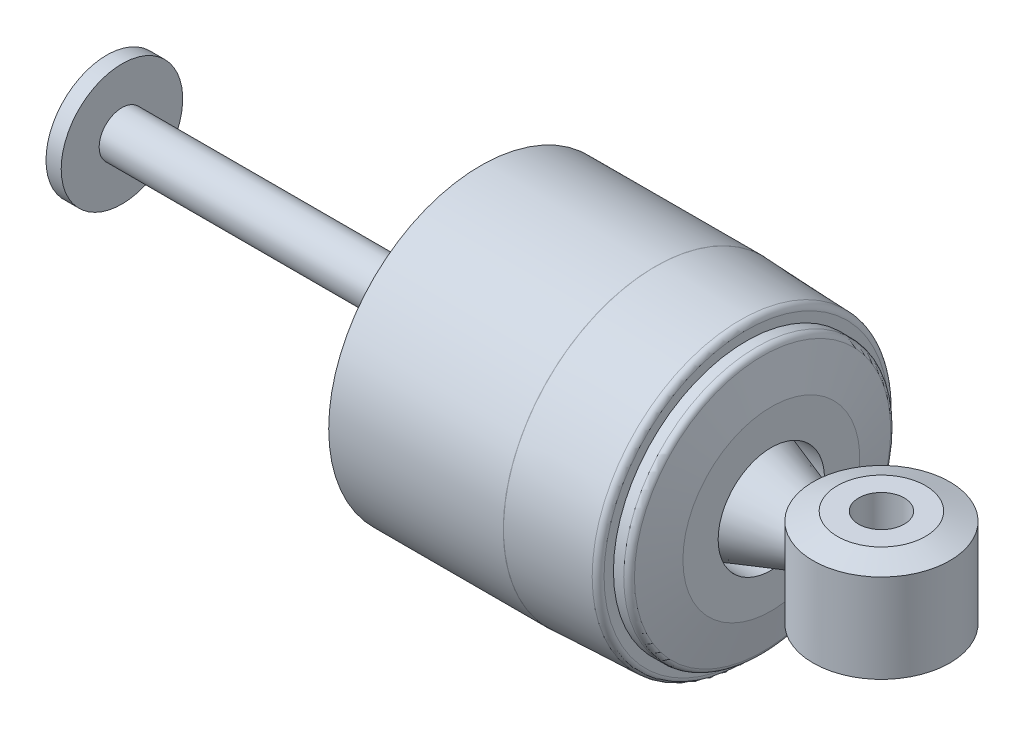
ISO-10303-21;
HEADER;
FILE_DESCRIPTION(('STEP AP214'),'2;1');
FILE_NAME('part.step','',(''),(''),'','','');
FILE_SCHEMA(('AUTOMOTIVE_DESIGN { 1 0 10303 214 1 1 1 1 }'));
ENDSEC;
DATA;
#1=APPLICATION_CONTEXT('core data for automotive mechanical design processes');
#2=APPLICATION_PROTOCOL_DEFINITION('international standard','automotive_design',2000,#1);
#3=PRODUCT_CONTEXT('',#1,'mechanical');
#4=PRODUCT('Part','Part','',(#3));
#5=PRODUCT_RELATED_PRODUCT_CATEGORY('part','',(#4));
#6=PRODUCT_DEFINITION_FORMATION('','',#4);
#7=PRODUCT_DEFINITION_CONTEXT('part definition',#1,'design');
#8=PRODUCT_DEFINITION('design','',#6,#7);
#9=PRODUCT_DEFINITION_SHAPE('','',#8);
#10=(LENGTH_UNIT() NAMED_UNIT(*) SI_UNIT(.MILLI.,.METRE.));
#11=(NAMED_UNIT(*) PLANE_ANGLE_UNIT() SI_UNIT($,.RADIAN.));
#12=(NAMED_UNIT(*) SI_UNIT($,.STERADIAN.) SOLID_ANGLE_UNIT());
#13=UNCERTAINTY_MEASURE_WITH_UNIT(LENGTH_MEASURE(1.E-05),#10,'distance_accuracy_value','');
#14=(GEOMETRIC_REPRESENTATION_CONTEXT(3) GLOBAL_UNCERTAINTY_ASSIGNED_CONTEXT((#13)) GLOBAL_UNIT_ASSIGNED_CONTEXT((#10,
#11,#12)) REPRESENTATION_CONTEXT('',''));
#15=CARTESIAN_POINT('',(0.,0.,0.));
#16=DIRECTION('',(0.,0.,1.));
#17=DIRECTION('',(1.,0.,0.));
#18=AXIS2_PLACEMENT_3D('',#15,#16,#17);
#19=CARTESIAN_POINT('',(93.9177238419156,11.1125,-7.51423949772596));
#20=DIRECTION('',(0.,1.,0.));
#21=DIRECTION('',(0.,0.,1.));
#22=AXIS2_PLACEMENT_3D('',#19,#20,#21);
#23=PLANE('',#22);
#24=CARTESIAN_POINT('',(93.9177238419156,11.1125,-7.51423949772596));
#25=DIRECTION('',(0.,1.,0.));
#26=DIRECTION('',(0.,0.,1.));
#27=AXIS2_PLACEMENT_3D('',#24,#25,#26);
#28=CIRCLE('',#27,9.20749999999994);
#29=CARTESIAN_POINT('',(93.9177238419156,11.1125,-16.7217394977259));
#30=VERTEX_POINT('',#29);
#31=EDGE_CURVE('E11',#30,#30,#28,.T.);
#32=ORIENTED_EDGE('',*,*,#31,.T.);
#33=EDGE_LOOP('',(#32));
#34=FACE_BOUND('',#33,.T.);
#35=CARTESIAN_POINT('',(93.9177238419156,11.1125,-7.51423949772596));
#36=DIRECTION('',(0.,1.,0.));
#37=DIRECTION('',(0.,0.,1.));
#38=AXIS2_PLACEMENT_3D('',#35,#36,#37);
#39=CIRCLE('',#38,4.7625);
#40=CARTESIAN_POINT('',(93.9177238419156,11.1125,-2.75173949772597));
#41=VERTEX_POINT('',#40);
#42=EDGE_CURVE('E64',#41,#41,#39,.T.);
#43=ORIENTED_EDGE('',*,*,#42,.F.);
#44=EDGE_LOOP('',(#43));
#45=FACE_BOUND('',#44,.T.);
#46=ADVANCED_FACE('F44',(#34,#45),#23,.T.);
#47=CARTESIAN_POINT('',(93.9177238419156,-11.1125,-7.51423949772596));
#48=DIRECTION('',(0.,1.,0.));
#49=DIRECTION('',(0.,0.,1.));
#50=AXIS2_PLACEMENT_3D('',#47,#48,#49);
#51=PLANE('',#50);
#52=CARTESIAN_POINT('',(93.9177238419156,-11.1125,-7.51423949772596));
#53=DIRECTION('',(0.,1.,0.));
#54=DIRECTION('',(0.,0.,1.));
#55=AXIS2_PLACEMENT_3D('',#52,#53,#54);
#56=CIRCLE('',#55,9.20749999999994);
#57=CARTESIAN_POINT('',(93.9177238419156,-11.1125,1.69326050227398));
#58=VERTEX_POINT('',#57);
#59=EDGE_CURVE('E51',#58,#58,#56,.F.);
#60=ORIENTED_EDGE('',*,*,#59,.T.);
#61=EDGE_LOOP('',(#60));
#62=FACE_BOUND('',#61,.T.);
#63=CARTESIAN_POINT('',(93.9177238419156,-11.1125,-7.51423949772596));
#64=DIRECTION('',(0.,1.,0.));
#65=DIRECTION('',(0.,0.,1.));
#66=AXIS2_PLACEMENT_3D('',#63,#64,#65);
#67=CIRCLE('',#66,4.7625);
#68=CARTESIAN_POINT('',(93.9177238419156,-11.1125,-2.75173949772597));
#69=VERTEX_POINT('',#68);
#70=EDGE_CURVE('E65',#69,#69,#67,.T.);
#71=ORIENTED_EDGE('',*,*,#70,.T.);
#72=EDGE_LOOP('',(#71));
#73=FACE_BOUND('',#72,.T.);
#74=ADVANCED_FACE('F75',(#62,#73),#51,.F.);
#75=CARTESIAN_POINT('',(93.9177238419156,11.1125,-7.51423949772596));
#76=DIRECTION('',(0.,-1.,0.));
#77=DIRECTION('',(0.,0.,-1.));
#78=AXIS2_PLACEMENT_3D('',#75,#76,#77);
#79=CYLINDRICAL_SURFACE('',#78,14.2875);
#80=CARTESIAN_POINT('',(93.9177238419156,-9.26353120992769,-7.51423949772596));
#81=DIRECTION('',(0.,1.,0.));
#82=DIRECTION('',(0.,0.,1.));
#83=AXIS2_PLACEMENT_3D('',#80,#81,#82);
#84=CIRCLE('',#83,14.2875);
#85=CARTESIAN_POINT('',(93.9177238419156,-9.26353120992769,-21.801739497726));
#86=VERTEX_POINT('',#85);
#87=EDGE_CURVE('E55',#86,#86,#84,.T.);
#88=CARTESIAN_POINT('',(93.9177238419156,9.26353120992769,-7.51423949772596));
#89=DIRECTION('',(0.,1.,0.));
#90=DIRECTION('',(0.,0.,1.));
#91=AXIS2_PLACEMENT_3D('',#88,#89,#90);
#92=CIRCLE('',#91,14.2875);
#93=CARTESIAN_POINT('',(93.9177238419156,9.26353120992769,-21.801739497726));
#94=VERTEX_POINT('',#93);
#95=EDGE_CURVE('E59',#94,#94,#92,.F.);
#96=CARTESIAN_POINT('',(93.9177238419156,-9.26353120992769,-21.801739497726));
#97=CARTESIAN_POINT('',(93.9177238419156,-9.07054097638753,-21.801739497726));
#98=CARTESIAN_POINT('',(93.9177238419156,-8.87755074284737,-21.801739497726));
#99=CARTESIAN_POINT('',(93.9177238419156,-8.49157027576705,-21.801739497726));
#100=CARTESIAN_POINT('',(93.9177238419156,-8.29858004222689,-21.801739497726));
#101=CARTESIAN_POINT('',(93.9177238419156,-7.91259957514657,-21.801739497726));
#102=CARTESIAN_POINT('',(93.9177238419156,-7.71960934160641,-21.801739497726));
#103=CARTESIAN_POINT('',(93.9177238419156,-7.33362887452609,-21.801739497726));
#104=CARTESIAN_POINT('',(93.9177238419156,-7.14063864098593,-21.801739497726));
#105=CARTESIAN_POINT('',(93.9177238419156,-6.75465817390561,-21.801739497726));
#106=CARTESIAN_POINT('',(93.9177238419156,-6.56166794036545,-21.801739497726));
#107=CARTESIAN_POINT('',(93.9177238419156,-6.17568747328513,-21.801739497726));
#108=CARTESIAN_POINT('',(93.9177238419156,-5.98269723974497,-21.801739497726));
#109=CARTESIAN_POINT('',(93.9177238419156,-5.59671677266465,-21.801739497726));
#110=CARTESIAN_POINT('',(93.9177238419156,-5.40372653912449,-21.801739497726));
#111=CARTESIAN_POINT('',(93.9177238419156,-5.01774607204417,-21.801739497726));
#112=CARTESIAN_POINT('',(93.9177238419156,-4.824755838504,-21.801739497726));
#113=CARTESIAN_POINT('',(93.9177238419156,-4.43877537142368,-21.801739497726));
#114=CARTESIAN_POINT('',(93.9177238419156,-4.24578513788352,-21.801739497726));
#115=CARTESIAN_POINT('',(93.9177238419156,-3.8598046708032,-21.801739497726));
#116=CARTESIAN_POINT('',(93.9177238419156,-3.66681443726304,-21.801739497726));
#117=CARTESIAN_POINT('',(93.9177238419156,-3.28083397018272,-21.801739497726));
#118=CARTESIAN_POINT('',(93.9177238419156,-3.08784373664256,-21.801739497726));
#119=CARTESIAN_POINT('',(93.9177238419156,-2.70186326956224,-21.801739497726));
#120=CARTESIAN_POINT('',(93.9177238419156,-2.50887303602208,-21.801739497726));
#121=CARTESIAN_POINT('',(93.9177238419156,-2.12289256894176,-21.801739497726));
#122=CARTESIAN_POINT('',(93.9177238419156,-1.9299023354016,-21.801739497726));
#123=CARTESIAN_POINT('',(93.9177238419156,-1.54392186832128,-21.801739497726));
#124=CARTESIAN_POINT('',(93.9177238419156,-1.35093163478112,-21.801739497726));
#125=CARTESIAN_POINT('',(93.9177238419156,-0.964951167700801,-21.801739497726));
#126=CARTESIAN_POINT('',(93.9177238419156,-0.77196093416064,-21.801739497726));
#127=CARTESIAN_POINT('',(93.9177238419156,-0.38598046708032,-21.801739497726));
#128=CARTESIAN_POINT('',(93.9177238419156,-0.19299023354016,-21.801739497726));
#129=CARTESIAN_POINT('',(93.9177238419156,0.19299023354016,-21.801739497726));
#130=CARTESIAN_POINT('',(93.9177238419156,0.38598046708032,-21.801739497726));
#131=CARTESIAN_POINT('',(93.9177238419156,0.77196093416064,-21.801739497726));
#132=CARTESIAN_POINT('',(93.9177238419156,0.964951167700801,-21.801739497726));
#133=CARTESIAN_POINT('',(93.9177238419156,1.35093163478112,-21.801739497726));
#134=CARTESIAN_POINT('',(93.9177238419156,1.54392186832128,-21.801739497726));
#135=CARTESIAN_POINT('',(93.9177238419156,1.9299023354016,-21.801739497726));
#136=CARTESIAN_POINT('',(93.9177238419156,2.12289256894176,-21.801739497726));
#137=CARTESIAN_POINT('',(93.9177238419156,2.50887303602208,-21.801739497726));
#138=CARTESIAN_POINT('',(93.9177238419156,2.70186326956224,-21.801739497726));
#139=CARTESIAN_POINT('',(93.9177238419156,3.08784373664256,-21.801739497726));
#140=CARTESIAN_POINT('',(93.9177238419156,3.28083397018272,-21.801739497726));
#141=CARTESIAN_POINT('',(93.9177238419156,3.66681443726304,-21.801739497726));
#142=CARTESIAN_POINT('',(93.9177238419156,3.8598046708032,-21.801739497726));
#143=CARTESIAN_POINT('',(93.9177238419156,4.24578513788352,-21.801739497726));
#144=CARTESIAN_POINT('',(93.9177238419156,4.43877537142368,-21.801739497726));
#145=CARTESIAN_POINT('',(93.9177238419156,4.824755838504,-21.801739497726));
#146=CARTESIAN_POINT('',(93.9177238419156,5.01774607204417,-21.801739497726));
#147=CARTESIAN_POINT('',(93.9177238419156,5.40372653912449,-21.801739497726));
#148=CARTESIAN_POINT('',(93.9177238419156,5.59671677266465,-21.801739497726));
#149=CARTESIAN_POINT('',(93.9177238419156,5.98269723974497,-21.801739497726));
#150=CARTESIAN_POINT('',(93.9177238419156,6.17568747328513,-21.801739497726));
#151=CARTESIAN_POINT('',(93.9177238419156,6.56166794036545,-21.801739497726));
#152=CARTESIAN_POINT('',(93.9177238419156,6.75465817390561,-21.801739497726));
#153=CARTESIAN_POINT('',(93.9177238419156,7.14063864098593,-21.801739497726));
#154=CARTESIAN_POINT('',(93.9177238419156,7.33362887452609,-21.801739497726));
#155=CARTESIAN_POINT('',(93.9177238419156,7.71960934160641,-21.801739497726));
#156=CARTESIAN_POINT('',(93.9177238419156,7.91259957514657,-21.801739497726));
#157=CARTESIAN_POINT('',(93.9177238419156,8.29858004222689,-21.801739497726));
#158=CARTESIAN_POINT('',(93.9177238419156,8.49157027576705,-21.801739497726));
#159=CARTESIAN_POINT('',(93.9177238419156,8.87755074284737,-21.801739497726));
#160=CARTESIAN_POINT('',(93.9177238419156,9.07054097638753,-21.801739497726));
#161=CARTESIAN_POINT('',(93.9177238419156,9.26353120992769,-21.801739497726));
#162=B_SPLINE_CURVE_WITH_KNOTS('',3,(#96,#97,#98,#99,#100,#101,#102,#103,#104,#105,#106,#107,
#108,#109,#110,#111,#112,#113,#114,#115,#116,#117,#118,#119,#120,#121,#122,#123,#124,#125,#126,
#127,#128,#129,#130,#131,#132,#133,#134,#135,#136,#137,#138,#139,#140,#141,#142,#143,#144,#145,
#146,#147,#148,#149,#150,#151,#152,#153,#154,#155,#156,#157,#158,#159,#160,#161),.UNSPECIFIED.,
.F.,.F.,(4,2,2,2,2,2,2,2,2,2,2,2,2,2,2,2,2,2,2,2,2,2,2,2,2,2,2,2,2,2,2,2,4),(0.,
0.57897070062048,1.15794140124096,1.73691210186144,2.31588280248192,2.8948535031024,
3.47382420372288,4.05279490434336,4.63176560496385,5.21073630558433,5.78970700620481,
6.36867770682529,6.94764840744577,7.52661910806625,8.10558980868673,8.68456050930721,
9.26353120992769,9.84250191054817,10.4214726111687,11.0004433117891,11.5794140124096,
12.1583847130301,12.7373554136506,13.3163261142711,13.8952968148915,14.474267515512,
15.0532382161325,15.632208916753,16.2111796173735,16.7901503179939,17.3691210186144,
17.9480917192349,18.5270624198554),.UNSPECIFIED.);
#163=EDGE_CURVE('BSEAM80',#86,#94,#162,.T.);
#164=ORIENTED_EDGE('',*,*,#87,.T.);
#165=ORIENTED_EDGE('',*,*,#95,.T.);
#166=ORIENTED_EDGE('',*,*,#163,.T.);
#167=ORIENTED_EDGE('',*,*,#163,.F.);
#168=EDGE_LOOP('',(#164,#166,#165,#167));
#169=FACE_BOUND('',#168,.T.);
#170=ADVANCED_FACE('F80',(#169),#79,.T.);
#171=CARTESIAN_POINT('',(93.9177238419156,11.1125,-7.51423949772596));
#172=DIRECTION('',(0.,-1.,0.));
#173=DIRECTION('',(0.,0.,-1.));
#174=AXIS2_PLACEMENT_3D('',#171,#172,#173);
#175=CYLINDRICAL_SURFACE('',#174,4.7625);
#176=ORIENTED_EDGE('',*,*,#42,.T.);
#177=EDGE_LOOP('',(#176));
#178=FACE_BOUND('',#177,.T.);
#179=ORIENTED_EDGE('',*,*,#70,.F.);
#180=EDGE_LOOP('',(#179));
#181=FACE_BOUND('',#180,.T.);
#182=ADVANCED_FACE('F71',(#178,#181),#175,.F.);
#183=CARTESIAN_POINT('',(93.9177238419156,-9.26353120992769,-7.51423949772596));
#184=DIRECTION('',(0.,1.,0.));
#185=DIRECTION('',(0.,0.,1.));
#186=AXIS2_PLACEMENT_3D('',#183,#184,#185);
#187=CONICAL_SURFACE('',#186,14.2875,1.22173047639603);
#188=ORIENTED_EDGE('',*,*,#59,.F.);
#189=EDGE_LOOP('',(#188));
#190=FACE_BOUND('',#189,.T.);
#191=ORIENTED_EDGE('',*,*,#87,.F.);
#192=EDGE_LOOP('',(#191));
#193=FACE_BOUND('',#192,.T.);
#194=ADVANCED_FACE('F86',(#190,#193),#187,.T.);
#195=CARTESIAN_POINT('',(93.9177238419156,11.1125,-7.51423949772596));
#196=DIRECTION('',(0.,-1.,0.));
#197=DIRECTION('',(0.,0.,-1.));
#198=AXIS2_PLACEMENT_3D('',#195,#196,#197);
#199=CONICAL_SURFACE('',#198,9.20749999999994,1.22173047639603);
#200=CARTESIAN_POINT('',(93.9177238419156,9.26353120992769,-21.801739497726));
#201=CARTESIAN_POINT('',(93.9177238419156,9.28279130149094,-21.7488228310593));
#202=CARTESIAN_POINT('',(93.9177238419156,9.3020513930542,-21.6959061643926));
#203=CARTESIAN_POINT('',(93.9177238419156,9.3405715761807,-21.5900728310593));
#204=CARTESIAN_POINT('',(93.9177238419156,9.35983166774395,-21.5371561643926));
#205=CARTESIAN_POINT('',(93.9177238419156,9.39835185087046,-21.4313228310593));
#206=CARTESIAN_POINT('',(93.9177238419156,9.41761194243372,-21.3784061643926));
#207=CARTESIAN_POINT('',(93.9177238419156,9.45613212556022,-21.2725728310593));
#208=CARTESIAN_POINT('',(93.9177238419156,9.47539221712347,-21.2196561643926));
#209=CARTESIAN_POINT('',(93.9177238419156,9.51391240024998,-21.1138228310593));
#210=CARTESIAN_POINT('',(93.9177238419156,9.53317249181323,-21.0609061643926));
#211=CARTESIAN_POINT('',(93.9177238419156,9.57169267493974,-20.9550728310593));
#212=CARTESIAN_POINT('',(93.9177238419156,9.59095276650299,-20.9021561643926));
#213=CARTESIAN_POINT('',(93.9177238419156,9.6294729496295,-20.7963228310593));
#214=CARTESIAN_POINT('',(93.9177238419156,9.64873304119275,-20.7434061643926));
#215=CARTESIAN_POINT('',(93.9177238419156,9.68725322431926,-20.6375728310593));
#216=CARTESIAN_POINT('',(93.9177238419156,9.70651331588251,-20.5846561643926));
#217=CARTESIAN_POINT('',(93.9177238419156,9.74503349900902,-20.4788228310593));
#218=CARTESIAN_POINT('',(93.9177238419156,9.76429359057227,-20.4259061643926));
#219=CARTESIAN_POINT('',(93.9177238419156,9.80281377369878,-20.3200728310593));
#220=CARTESIAN_POINT('',(93.9177238419156,9.82207386526203,-20.2671561643926));
#221=CARTESIAN_POINT('',(93.9177238419156,9.86059404838854,-20.1613228310593));
#222=CARTESIAN_POINT('',(93.9177238419156,9.87985413995179,-20.1084061643926));
#223=CARTESIAN_POINT('',(93.9177238419156,9.9183743230783,-20.0025728310593));
#224=CARTESIAN_POINT('',(93.9177238419156,9.93763441464155,-19.9496561643926));
#225=CARTESIAN_POINT('',(93.9177238419156,9.97615459776806,-19.8438228310593));
#226=CARTESIAN_POINT('',(93.9177238419156,9.99541468933131,-19.7909061643926));
#227=CARTESIAN_POINT('',(93.9177238419156,10.0339348724578,-19.6850728310593));
#228=CARTESIAN_POINT('',(93.9177238419156,10.0531949640211,-19.6321561643926));
#229=CARTESIAN_POINT('',(93.9177238419156,10.0917151471476,-19.5263228310593));
#230=CARTESIAN_POINT('',(93.9177238419156,10.1109752387108,-19.4734061643926));
#231=CARTESIAN_POINT('',(93.9177238419156,10.1494954218373,-19.3675728310593));
#232=CARTESIAN_POINT('',(93.9177238419156,10.1687555134006,-19.3146561643926));
#233=CARTESIAN_POINT('',(93.9177238419156,10.2072756965271,-19.2088228310593));
#234=CARTESIAN_POINT('',(93.9177238419156,10.2265357880904,-19.1559061643926));
#235=CARTESIAN_POINT('',(93.9177238419156,10.2650559712169,-19.0500728310593));
#236=CARTESIAN_POINT('',(93.9177238419156,10.2843160627801,-18.9971561643926));
#237=CARTESIAN_POINT('',(93.9177238419156,10.3228362459066,-18.8913228310593));
#238=CARTESIAN_POINT('',(93.9177238419156,10.3420963374699,-18.8384061643926));
#239=CARTESIAN_POINT('',(93.9177238419156,10.3806165205964,-18.7325728310593));
#240=CARTESIAN_POINT('',(93.9177238419156,10.3998766121596,-18.6796561643926));
#241=CARTESIAN_POINT('',(93.9177238419156,10.4383967952861,-18.5738228310593));
#242=CARTESIAN_POINT('',(93.9177238419156,10.4576568868494,-18.5209061643926));
#243=CARTESIAN_POINT('',(93.9177238419156,10.4961770699759,-18.4150728310593));
#244=CARTESIAN_POINT('',(93.9177238419156,10.5154371615391,-18.3621561643926));
#245=CARTESIAN_POINT('',(93.9177238419156,10.5539573446657,-18.2563228310593));
#246=CARTESIAN_POINT('',(93.9177238419156,10.5732174362289,-18.2034061643926));
#247=CARTESIAN_POINT('',(93.9177238419156,10.6117376193554,-18.0975728310593));
#248=CARTESIAN_POINT('',(93.9177238419156,10.6309977109187,-18.0446561643926));
#249=CARTESIAN_POINT('',(93.9177238419156,10.6695178940452,-17.9388228310593));
#250=CARTESIAN_POINT('',(93.9177238419156,10.6887779856084,-17.8859061643926));
#251=CARTESIAN_POINT('',(93.9177238419156,10.7272981687349,-17.7800728310593));
#252=CARTESIAN_POINT('',(93.9177238419156,10.7465582602982,-17.7271561643926));
#253=CARTESIAN_POINT('',(93.9177238419156,10.7850784434247,-17.6213228310593));
#254=CARTESIAN_POINT('',(93.9177238419156,10.8043385349879,-17.5684061643926));
#255=CARTESIAN_POINT('',(93.9177238419156,10.8428587181145,-17.4625728310593));
#256=CARTESIAN_POINT('',(93.9177238419156,10.8621188096777,-17.4096561643926));
#257=CARTESIAN_POINT('',(93.9177238419156,10.9006389928042,-17.3038228310593));
#258=CARTESIAN_POINT('',(93.9177238419156,10.9198990843675,-17.2509061643926));
#259=CARTESIAN_POINT('',(93.9177238419156,10.958419267494,-17.1450728310592));
#260=CARTESIAN_POINT('',(93.9177238419156,10.9776793590572,-17.0921561643926));
#261=CARTESIAN_POINT('',(93.9177238419156,11.0161995421837,-16.9863228310592));
#262=CARTESIAN_POINT('',(93.9177238419156,11.035459633747,-16.9334061643926));
#263=CARTESIAN_POINT('',(93.9177238419156,11.0739798168735,-16.8275728310592));
#264=CARTESIAN_POINT('',(93.9177238419156,11.0932399084367,-16.7746561643926));
#265=CARTESIAN_POINT('',(93.9177238419156,11.1125,-16.7217394977259));
#266=B_SPLINE_CURVE_WITH_KNOTS('',3,(#200,#201,#202,#203,#204,#205,#206,#207,#208,#209,#210,
#211,#212,#213,#214,#215,#216,#217,#218,#219,#220,#221,#222,#223,#224,#225,#226,#227,#228,#229,
#230,#231,#232,#233,#234,#235,#236,#237,#238,#239,#240,#241,#242,#243,#244,#245,#246,#247,#248,
#249,#250,#251,#252,#253,#254,#255,#256,#257,#258,#259,#260,#261,#262,#263,#264,#265),
.UNSPECIFIED.,.F.,.F.,(4,2,2,2,2,2,2,2,2,2,2,2,2,2,2,2,2,2,2,2,2,2,2,2,2,2,2,2,2,2,2,2,4),(0.,
0.168938221380553,0.337876442761107,0.506814664141657,0.675752885522211,0.844691106902761,
1.01362932828331,1.18256754966387,1.35150577104442,1.52044399242497,1.68938221380553,
1.85832043518608,2.02725865656663,2.19619687794718,2.36513509932774,2.53407332070829,
2.70301154208884,2.87194976346939,3.04088798484994,3.2098262062305,3.37876442761105,
3.5477026489916,3.71664087037215,3.88557909175271,4.05451731313326,4.22345553451381,
4.39239375589437,4.56133197727492,4.73027019865547,4.89920842003602,5.06814664141657,
5.23708486279712,5.40602308417768),.UNSPECIFIED.);
#267=EDGE_CURVE('BSEAM46',#94,#30,#266,.T.);
#268=ORIENTED_EDGE('',*,*,#95,.F.);
#269=ORIENTED_EDGE('',*,*,#31,.F.);
#270=ORIENTED_EDGE('',*,*,#267,.T.);
#271=ORIENTED_EDGE('',*,*,#267,.F.);
#272=EDGE_LOOP('',(#268,#270,#269,#271));
#273=FACE_BOUND('',#272,.T.);
#274=ADVANCED_FACE('F46',(#273),#199,.T.);
#275=CLOSED_SHELL('',(#46,#74,#170,#182,#194,#274));
#276=MANIFOLD_SOLID_BREP('B2',#275);
#277=CARTESIAN_POINT('',(-68.0072761580844,0.,-7.51423949772596));
#278=DIRECTION('',(-1.,0.,0.));
#279=DIRECTION('',(0.,0.,1.));
#280=AXIS2_PLACEMENT_3D('',#277,#278,#279);
#281=CYLINDRICAL_SURFACE('',#280,4.7625);
#282=CARTESIAN_POINT('',(-64.8322761580844,0.,-7.51423949772596));
#283=DIRECTION('',(-1.,0.,0.));
#284=DIRECTION('',(0.,0.,1.));
#285=AXIS2_PLACEMENT_3D('',#282,#283,#284);
#286=CIRCLE('',#285,4.7625);
#287=CARTESIAN_POINT('',(-64.8322761580844,0.,-2.75173949772596));
#288=VERTEX_POINT('',#287);
#289=EDGE_CURVE('E171',#288,#288,#286,.T.);
#290=ORIENTED_EDGE('',*,*,#289,.F.);
#291=EDGE_LOOP('',(#290));
#292=FACE_BOUND('',#291,.T.);
#293=CARTESIAN_POINT('',(64.5489738419155,0.,-7.51423949772596));
#294=DIRECTION('',(-1.,0.,0.));
#295=DIRECTION('',(0.,0.,1.));
#296=AXIS2_PLACEMENT_3D('',#293,#294,#295);
#297=CIRCLE('',#296,4.7625);
#298=CARTESIAN_POINT('',(64.5489738419155,0.,-2.75173949772597));
#299=VERTEX_POINT('',#298);
#300=EDGE_CURVE('E204',#299,#299,#297,.T.);
#301=ORIENTED_EDGE('',*,*,#300,.T.);
#302=EDGE_LOOP('',(#301));
#303=FACE_BOUND('',#302,.T.);
#304=ADVANCED_FACE('F139',(#292,#303),#281,.T.);
#305=CARTESIAN_POINT('',(-68.0072761580844,0.,-7.51227510874306));
#306=DIRECTION('',(-1.,0.,0.));
#307=DIRECTION('',(0.,0.,1.));
#308=AXIS2_PLACEMENT_3D('',#305,#306,#307);
#309=PLANE('',#308);
#310=CARTESIAN_POINT('',(-68.0072761580844,0.,-7.51423949772596));
#311=DIRECTION('',(-1.,0.,0.));
#312=DIRECTION('',(0.,0.,1.));
#313=AXIS2_PLACEMENT_3D('',#310,#311,#312);
#314=CIRCLE('',#313,12.7);
#315=CARTESIAN_POINT('',(-68.0072761580844,0.,5.18576050227404));
#316=VERTEX_POINT('',#315);
#317=EDGE_CURVE('E177',#316,#316,#314,.T.);
#318=ORIENTED_EDGE('',*,*,#317,.T.);
#319=EDGE_LOOP('',(#318));
#320=FACE_BOUND('',#319,.T.);
#321=ADVANCED_FACE('F252',(#320),#309,.T.);
#322=CARTESIAN_POINT('',(-64.8322761580844,0.,-7.51227510874306));
#323=DIRECTION('',(1.,0.,0.));
#324=DIRECTION('',(0.,0.,-1.));
#325=AXIS2_PLACEMENT_3D('',#322,#323,#324);
#326=PLANE('',#325);
#327=ORIENTED_EDGE('',*,*,#289,.T.);
#328=EDGE_LOOP('',(#327));
#329=FACE_BOUND('',#328,.T.);
#330=CARTESIAN_POINT('',(-64.8322761580844,0.,-7.51423949772596));
#331=DIRECTION('',(-1.,0.,0.));
#332=DIRECTION('',(0.,0.,1.));
#333=AXIS2_PLACEMENT_3D('',#330,#331,#332);
#334=CIRCLE('',#333,12.7);
#335=CARTESIAN_POINT('',(-64.8322761580844,0.,5.18576050227404));
#336=VERTEX_POINT('',#335);
#337=EDGE_CURVE('E174',#336,#336,#334,.T.);
#338=ORIENTED_EDGE('',*,*,#337,.F.);
#339=EDGE_LOOP('',(#338));
#340=FACE_BOUND('',#339,.T.);
#341=ADVANCED_FACE('F258',(#329,#340),#326,.T.);
#342=CARTESIAN_POINT('',(-68.0072761580844,0.,-7.51423949772596));
#343=DIRECTION('',(-1.,0.,0.));
#344=DIRECTION('',(0.,0.,1.));
#345=AXIS2_PLACEMENT_3D('',#342,#343,#344);
#346=CYLINDRICAL_SURFACE('',#345,12.7);
#347=ORIENTED_EDGE('',*,*,#337,.T.);
#348=EDGE_LOOP('',(#347));
#349=FACE_BOUND('',#348,.T.);
#350=ORIENTED_EDGE('',*,*,#317,.F.);
#351=EDGE_LOOP('',(#350));
#352=FACE_BOUND('',#351,.T.);
#353=ADVANCED_FACE('F307',(#349,#352),#346,.T.);
#354=CARTESIAN_POINT('',(-68.0866511938352,0.,-7.51423949772596));
#355=DIRECTION('',(-1.,0.,0.));
#356=DIRECTION('',(0.,0.,1.));
#357=AXIS2_PLACEMENT_3D('',#354,#355,#356);
#358=CYLINDRICAL_SURFACE('',#357,11.1125);
#359=CARTESIAN_POINT('',(70.8989738419155,0.,-7.51423949772596));
#360=DIRECTION('',(-1.,0.,0.));
#361=DIRECTION('',(0.,0.,1.));
#362=AXIS2_PLACEMENT_3D('',#359,#360,#361);
#363=CIRCLE('',#362,11.1125);
#364=CARTESIAN_POINT('',(70.8989738419155,0.,3.59826050227404));
#365=VERTEX_POINT('',#364);
#366=EDGE_CURVE('E180',#365,#365,#363,.T.);
#367=ORIENTED_EDGE('',*,*,#366,.F.);
#368=EDGE_LOOP('',(#367));
#369=FACE_BOUND('',#368,.T.);
#370=CARTESIAN_POINT('',(65.3427238419155,0.,-7.51423949772596));
#371=DIRECTION('',(-1.,0.,0.));
#372=DIRECTION('',(0.,0.,1.));
#373=AXIS2_PLACEMENT_3D('',#370,#371,#372);
#374=CIRCLE('',#373,11.1125);
#375=CARTESIAN_POINT('',(65.3427238419155,0.,3.59826050227404));
#376=VERTEX_POINT('',#375);
#377=EDGE_CURVE('E168',#376,#376,#374,.T.);
#378=ORIENTED_EDGE('',*,*,#377,.T.);
#379=EDGE_LOOP('',(#378));
#380=FACE_BOUND('',#379,.T.);
#381=ADVANCED_FACE('F304',(#369,#380),#358,.F.);
#382=CARTESIAN_POINT('',(70.8989738419155,0.,-18.626739497726));
#383=DIRECTION('',(-1.,0.,0.));
#384=DIRECTION('',(0.,0.,1.));
#385=AXIS2_PLACEMENT_3D('',#382,#383,#384);
#386=PLANE('',#385);
#387=CARTESIAN_POINT('',(70.8989738419155,0.,-7.51423949772596));
#388=DIRECTION('',(-1.,0.,0.));
#389=DIRECTION('',(0.,0.,1.));
#390=AXIS2_PLACEMENT_3D('',#387,#388,#389);
#391=CIRCLE('',#390,18.4785);
#392=CARTESIAN_POINT('',(70.8989738419155,0.,10.964260502274));
#393=VERTEX_POINT('',#392);
#394=EDGE_CURVE('E183',#393,#393,#391,.T.);
#395=ORIENTED_EDGE('',*,*,#394,.F.);
#396=EDGE_LOOP('',(#395));
#397=FACE_BOUND('',#396,.T.);
#398=ORIENTED_EDGE('',*,*,#366,.T.);
#399=EDGE_LOOP('',(#398));
#400=FACE_BOUND('',#399,.T.);
#401=ADVANCED_FACE('F299',(#397,#400),#386,.F.);
#402=CARTESIAN_POINT('',(70.8989738419155,0.,-7.51423949772596));
#403=DIRECTION('',(-1.,0.,0.));
#404=DIRECTION('',(0.,0.,1.));
#405=AXIS2_PLACEMENT_3D('',#402,#403,#404);
#406=CONICAL_SURFACE('',#405,18.4785,1.35434936815079);
#407=CARTESIAN_POINT('',(69.0726645266316,0.,-7.51423949772596));
#408=DIRECTION('',(1.,0.,0.));
#409=DIRECTION('',(0.,0.,-1.));
#410=AXIS2_PLACEMENT_3D('',#407,#408,#409);
#411=CIRCLE('',#410,26.7839962781088);
#412=CARTESIAN_POINT('',(69.0726645266316,0.,-34.2982357758348));
#413=VERTEX_POINT('',#412);
#414=EDGE_CURVE('E43',#413,#413,#411,.T.);
#415=ORIENTED_EDGE('',*,*,#414,.T.);
#416=EDGE_LOOP('',(#415));
#417=FACE_BOUND('',#416,.T.);
#418=ORIENTED_EDGE('',*,*,#394,.T.);
#419=EDGE_LOOP('',(#418));
#420=FACE_BOUND('',#419,.T.);
#421=ADVANCED_FACE('F294',(#417,#420),#406,.T.);
#422=CARTESIAN_POINT('',(-68.0866511938352,0.,-7.51423949772596));
#423=DIRECTION('',(-1.,0.,0.));
#424=DIRECTION('',(0.,0.,1.));
#425=AXIS2_PLACEMENT_3D('',#422,#423,#424);
#426=CYLINDRICAL_SURFACE('',#425,27.78125);
#427=CARTESIAN_POINT('',(67.8322978599649,0.,-7.51423949772596));
#428=DIRECTION('',(1.,0.,0.));
#429=DIRECTION('',(0.,0.,-1.));
#430=AXIS2_PLACEMENT_3D('',#427,#428,#429);
#431=CIRCLE('',#430,27.78125);
#432=CARTESIAN_POINT('',(67.8322978599649,0.,-35.295489497726));
#433=VERTEX_POINT('',#432);
#434=EDGE_CURVE('E146',#433,#433,#431,.F.);
#435=ORIENTED_EDGE('',*,*,#434,.T.);
#436=EDGE_LOOP('',(#435));
#437=FACE_BOUND('',#436,.T.);
#438=CARTESIAN_POINT('',(65.6783767560992,0.,-7.51423949772596));
#439=DIRECTION('',(-1.,0.,0.));
#440=DIRECTION('',(0.,0.,1.));
#441=AXIS2_PLACEMENT_3D('',#438,#439,#440);
#442=CIRCLE('',#441,27.78125);
#443=CARTESIAN_POINT('',(65.6783767560992,0.,20.267010502274));
#444=VERTEX_POINT('',#443);
#445=EDGE_CURVE('E186',#444,#444,#442,.T.);
#446=ORIENTED_EDGE('',*,*,#445,.F.);
#447=EDGE_LOOP('',(#446));
#448=FACE_BOUND('',#447,.T.);
#449=ADVANCED_FACE('F289',(#437,#448),#426,.T.);
#450=CARTESIAN_POINT('',(65.6783767560992,0.,-35.295489497726));
#451=DIRECTION('',(-1.,0.,0.));
#452=DIRECTION('',(0.,0.,1.));
#453=AXIS2_PLACEMENT_3D('',#450,#451,#452);
#454=PLANE('',#453);
#455=CARTESIAN_POINT('',(65.6783767560992,0.,-7.51423949772596));
#456=DIRECTION('',(-1.,0.,0.));
#457=DIRECTION('',(0.,0.,1.));
#458=AXIS2_PLACEMENT_3D('',#455,#456,#457);
#459=CIRCLE('',#458,29.7381087930786);
#460=CARTESIAN_POINT('',(65.6783767560992,0.,22.2238692953526));
#461=VERTEX_POINT('',#460);
#462=EDGE_CURVE('E150',#461,#461,#459,.F.);
#463=ORIENTED_EDGE('',*,*,#462,.T.);
#464=EDGE_LOOP('',(#463));
#465=FACE_BOUND('',#464,.T.);
#466=ORIENTED_EDGE('',*,*,#445,.T.);
#467=EDGE_LOOP('',(#466));
#468=FACE_BOUND('',#467,.T.);
#469=ADVANCED_FACE('F248',(#465,#468),#454,.F.);
#470=CARTESIAN_POINT('',(65.6783767560992,0.,-7.51423949772596));
#471=DIRECTION('',(-1.,0.,0.));
#472=DIRECTION('',(0.,0.,1.));
#473=AXIS2_PLACEMENT_3D('',#470,#471,#472);
#474=CONICAL_SURFACE('',#473,30.95625,0.0416787324225788);
#475=CARTESIAN_POINT('',(46.6713672376545,0.,-7.51423949772596));
#476=DIRECTION('',(1.,0.,0.));
#477=DIRECTION('',(0.,0.,-1.));
#478=AXIS2_PLACEMENT_3D('',#475,#476,#477);
#479=CIRCLE('',#478,31.7488970905431);
#480=CARTESIAN_POINT('',(46.6713672376545,0.,-39.2631365882691));
#481=VERTEX_POINT('',#480);
#482=EDGE_CURVE('E154',#481,#481,#479,.T.);
#483=ORIENTED_EDGE('',*,*,#482,.T.);
#484=EDGE_LOOP('',(#483));
#485=FACE_BOUND('',#484,.T.);
#486=CARTESIAN_POINT('',(64.4612934227658,0.,-7.51423949772596));
#487=DIRECTION('',(1.,0.,0.));
#488=DIRECTION('',(0.,0.,-1.));
#489=AXIS2_PLACEMENT_3D('',#486,#487,#488);
#490=CIRCLE('',#489,31.0070058836217);
#491=CARTESIAN_POINT('',(64.4612934227658,0.,-38.5212453813477));
#492=VERTEX_POINT('',#491);
#493=EDGE_CURVE('E159',#492,#492,#490,.F.);
#494=ORIENTED_EDGE('',*,*,#493,.T.);
#495=EDGE_LOOP('',(#494));
#496=FACE_BOUND('',#495,.T.);
#497=ADVANCED_FACE('F242',(#485,#496),#474,.T.);
#498=CARTESIAN_POINT('',(-68.0866511938352,0.,-7.51423949772596));
#499=DIRECTION('',(-1.,0.,0.));
#500=DIRECTION('',(0.,0.,1.));
#501=AXIS2_PLACEMENT_3D('',#498,#499,#500);
#502=CYLINDRICAL_SURFACE('',#501,31.75);
#503=CARTESIAN_POINT('',(46.6184505709878,0.,-7.51423949772596));
#504=DIRECTION('',(1.,0.,0.));
#505=DIRECTION('',(0.,0.,-1.));
#506=AXIS2_PLACEMENT_3D('',#503,#504,#505);
#507=CIRCLE('',#506,31.75);
#508=CARTESIAN_POINT('',(46.6184505709878,0.,-39.264239497726));
#509=VERTEX_POINT('',#508);
#510=EDGE_CURVE('E162',#509,#509,#507,.F.);
#511=ORIENTED_EDGE('',*,*,#510,.T.);
#512=EDGE_LOOP('',(#511));
#513=FACE_BOUND('',#512,.T.);
#514=CARTESIAN_POINT('',(10.1324203979518,0.,-7.51423949772596));
#515=DIRECTION('',(-1.,0.,0.));
#516=DIRECTION('',(0.,0.,1.));
#517=AXIS2_PLACEMENT_3D('',#514,#515,#516);
#518=CIRCLE('',#517,31.75);
#519=CARTESIAN_POINT('',(10.1324203979518,0.,24.235760502274));
#520=VERTEX_POINT('',#519);
#521=EDGE_CURVE('E189',#520,#520,#518,.T.);
#522=ORIENTED_EDGE('',*,*,#521,.F.);
#523=EDGE_LOOP('',(#522));
#524=FACE_BOUND('',#523,.T.);
#525=ADVANCED_FACE('F237',(#513,#524),#502,.T.);
#526=CARTESIAN_POINT('',(10.1324203979518,0.,-39.264239497726));
#527=DIRECTION('',(1.,0.,0.));
#528=DIRECTION('',(0.,0.,-1.));
#529=AXIS2_PLACEMENT_3D('',#526,#527,#528);
#530=PLANE('',#529);
#531=CARTESIAN_POINT('',(10.1324203979518,0.,-7.51423949772596));
#532=DIRECTION('',(-1.,0.,0.));
#533=DIRECTION('',(0.,0.,1.));
#534=AXIS2_PLACEMENT_3D('',#531,#532,#533);
#535=CIRCLE('',#534,30.95625);
#536=CARTESIAN_POINT('',(10.1324203979518,0.,23.442010502274));
#537=VERTEX_POINT('',#536);
#538=EDGE_CURVE('E192',#537,#537,#535,.T.);
#539=ORIENTED_EDGE('',*,*,#538,.F.);
#540=EDGE_LOOP('',(#539));
#541=FACE_BOUND('',#540,.T.);
#542=ORIENTED_EDGE('',*,*,#521,.T.);
#543=EDGE_LOOP('',(#542));
#544=FACE_BOUND('',#543,.T.);
#545=ADVANCED_FACE('F231',(#541,#544),#530,.F.);
#546=CARTESIAN_POINT('',(-68.0866511938352,0.,-7.51423949772596));
#547=DIRECTION('',(-1.,0.,0.));
#548=DIRECTION('',(0.,0.,1.));
#549=AXIS2_PLACEMENT_3D('',#546,#547,#548);
#550=CYLINDRICAL_SURFACE('',#549,30.95625);
#551=CARTESIAN_POINT('',(46.6283767560998,0.,-7.51423949772596));
#552=DIRECTION('',(-1.,0.,0.));
#553=DIRECTION('',(0.,0.,1.));
#554=AXIS2_PLACEMENT_3D('',#551,#552,#553);
#555=CIRCLE('',#554,30.95625);
#556=CARTESIAN_POINT('',(46.6283767560998,0.,23.442010502274));
#557=VERTEX_POINT('',#556);
#558=EDGE_CURVE('E195',#557,#557,#555,.T.);
#559=ORIENTED_EDGE('',*,*,#558,.F.);
#560=EDGE_LOOP('',(#559));
#561=FACE_BOUND('',#560,.T.);
#562=ORIENTED_EDGE('',*,*,#538,.T.);
#563=EDGE_LOOP('',(#562));
#564=FACE_BOUND('',#563,.T.);
#565=ADVANCED_FACE('F225',(#561,#564),#550,.F.);
#566=CARTESIAN_POINT('',(46.6283767560998,0.,-7.51423949772596));
#567=DIRECTION('',(-1.,0.,0.));
#568=DIRECTION('',(0.,0.,1.));
#569=AXIS2_PLACEMENT_3D('',#566,#567,#568);
#570=CONICAL_SURFACE('',#569,30.95625,0.0416787324225783);
#571=CARTESIAN_POINT('',(59.9436250328638,0.,-7.51423949772596));
#572=DIRECTION('',(-1.,0.,0.));
#573=DIRECTION('',(0.,0.,1.));
#574=AXIS2_PLACEMENT_3D('',#571,#572,#573);
#575=CIRCLE('',#574,30.4009657615092);
#576=CARTESIAN_POINT('',(59.9436250328638,0.,22.8867262637832));
#577=VERTEX_POINT('',#576);
#578=EDGE_CURVE('E198',#577,#577,#575,.T.);
#579=ORIENTED_EDGE('',*,*,#578,.F.);
#580=EDGE_LOOP('',(#579));
#581=FACE_BOUND('',#580,.T.);
#582=ORIENTED_EDGE('',*,*,#558,.T.);
#583=EDGE_LOOP('',(#582));
#584=FACE_BOUND('',#583,.T.);
#585=ADVANCED_FACE('F219',(#581,#584),#570,.F.);
#586=CARTESIAN_POINT('',(59.9436250328638,0.,-7.51423949772596));
#587=DIRECTION('',(-1.,0.,0.));
#588=DIRECTION('',(0.,0.,1.));
#589=AXIS2_PLACEMENT_3D('',#586,#587,#588);
#590=CONICAL_SURFACE('',#589,30.4009657615092,1.09746705903026);
#591=CARTESIAN_POINT('',(64.5489738419155,0.,-7.51423949772596));
#592=DIRECTION('',(-1.,0.,0.));
#593=DIRECTION('',(0.,0.,1.));
#594=AXIS2_PLACEMENT_3D('',#591,#592,#593);
#595=CIRCLE('',#594,21.4089771238296);
#596=CARTESIAN_POINT('',(64.5489738419155,0.,13.8947376261036));
#597=VERTEX_POINT('',#596);
#598=EDGE_CURVE('E201',#597,#597,#595,.T.);
#599=ORIENTED_EDGE('',*,*,#598,.F.);
#600=EDGE_LOOP('',(#599));
#601=FACE_BOUND('',#600,.T.);
#602=ORIENTED_EDGE('',*,*,#578,.T.);
#603=EDGE_LOOP('',(#602));
#604=FACE_BOUND('',#603,.T.);
#605=ADVANCED_FACE('F213',(#601,#604),#590,.F.);
#606=CARTESIAN_POINT('',(64.5489738419155,0.,-28.9232166215555));
#607=DIRECTION('',(1.,0.,0.));
#608=DIRECTION('',(0.,0.,-1.));
#609=AXIS2_PLACEMENT_3D('',#606,#607,#608);
#610=PLANE('',#609);
#611=ORIENTED_EDGE('',*,*,#300,.F.);
#612=EDGE_LOOP('',(#611));
#613=FACE_BOUND('',#612,.T.);
#614=ORIENTED_EDGE('',*,*,#598,.T.);
#615=EDGE_LOOP('',(#614));
#616=FACE_BOUND('',#615,.T.);
#617=ADVANCED_FACE('F209',(#613,#616),#610,.F.);
#618=CARTESIAN_POINT('',(81.3447238419155,0.,-7.51227510874306));
#619=DIRECTION('',(1.,0.,0.));
#620=DIRECTION('',(0.,0.,-1.));
#621=AXIS2_PLACEMENT_3D('',#618,#619,#620);
#622=PLANE('',#621);
#623=CARTESIAN_POINT('',(81.3447238419155,0.,-7.51423949772596));
#624=DIRECTION('',(-1.,0.,0.));
#625=DIRECTION('',(0.,0.,1.));
#626=AXIS2_PLACEMENT_3D('',#623,#624,#625);
#627=CIRCLE('',#626,5.71499999999999);
#628=CARTESIAN_POINT('',(81.3447238419155,0.,-1.79923949772597));
#629=VERTEX_POINT('',#628);
#630=EDGE_CURVE('E165',#629,#629,#627,.T.);
#631=ORIENTED_EDGE('',*,*,#630,.F.);
#632=EDGE_LOOP('',(#631));
#633=FACE_BOUND('',#632,.T.);
#634=ADVANCED_FACE('F212',(#633),#622,.T.);
#635=CARTESIAN_POINT('',(65.3427238419155,0.,-7.51423949772596));
#636=DIRECTION('',(-1.,0.,0.));
#637=DIRECTION('',(0.,0.,1.));
#638=AXIS2_PLACEMENT_3D('',#635,#636,#637);
#639=CONICAL_SURFACE('',#638,11.1125,0.325317721192493);
#640=ORIENTED_EDGE('',*,*,#630,.T.);
#641=EDGE_LOOP('',(#640));
#642=FACE_BOUND('',#641,.T.);
#643=ORIENTED_EDGE('',*,*,#377,.F.);
#644=EDGE_LOOP('',(#643));
#645=FACE_BOUND('',#644,.T.);
#646=ADVANCED_FACE('F265',(#642,#645),#639,.T.);
#647=CARTESIAN_POINT('',(46.6184505709878,0.,-7.51423949772596));
#648=DIRECTION('',(1.,0.,0.));
#649=DIRECTION('',(0.,0.,-1.));
#650=AXIS2_PLACEMENT_3D('',#647,#648,#649);
#651=TOROIDAL_SURFACE('',#650,30.48,1.27);
#652=ORIENTED_EDGE('',*,*,#482,.F.);
#653=EDGE_LOOP('',(#652));
#654=FACE_BOUND('',#653,.T.);
#655=ORIENTED_EDGE('',*,*,#510,.F.);
#656=EDGE_LOOP('',(#655));
#657=FACE_BOUND('',#656,.T.);
#658=ADVANCED_FACE('F268',(#654,#657),#651,.T.);
#659=CARTESIAN_POINT('',(64.4083767560992,0.,-7.51423949772596));
#660=DIRECTION('',(-1.,0.,0.));
#661=DIRECTION('',(0.,0.,1.));
#662=AXIS2_PLACEMENT_3D('',#659,#660,#661);
#663=TOROIDAL_SURFACE('',#662,29.7381087930786,1.27);
#664=ORIENTED_EDGE('',*,*,#462,.F.);
#665=EDGE_LOOP('',(#664));
#666=FACE_BOUND('',#665,.T.);
#667=ORIENTED_EDGE('',*,*,#493,.F.);
#668=EDGE_LOOP('',(#667));
#669=FACE_BOUND('',#668,.T.);
#670=ADVANCED_FACE('F274',(#666,#669),#663,.T.);
#671=CARTESIAN_POINT('',(67.8322978599649,0.,-7.51423949772596));
#672=DIRECTION('',(1.,0.,0.));
#673=DIRECTION('',(0.,0.,-1.));
#674=AXIS2_PLACEMENT_3D('',#671,#672,#673);
#675=TOROIDAL_SURFACE('',#674,26.51125,1.27);
#676=ORIENTED_EDGE('',*,*,#414,.F.);
#677=EDGE_LOOP('',(#676));
#678=FACE_BOUND('',#677,.T.);
#679=ORIENTED_EDGE('',*,*,#434,.F.);
#680=EDGE_LOOP('',(#679));
#681=FACE_BOUND('',#680,.T.);
#682=ADVANCED_FACE('F141',(#678,#681),#675,.T.);
#683=CLOSED_SHELL('',(#304,#321,#341,#353,#381,#401,#421,#449,#469,#497,#525,#545,#565,#585,
#605,#617,#634,#646,#658,#670,#682));
#684=MANIFOLD_SOLID_BREP('B6',#683);
#685=ADVANCED_BREP_SHAPE_REPRESENTATION('',(#18,#276,#684),#14);
#686=SHAPE_DEFINITION_REPRESENTATION(#9,#685);
ENDSEC;
END-ISO-10303-21;
